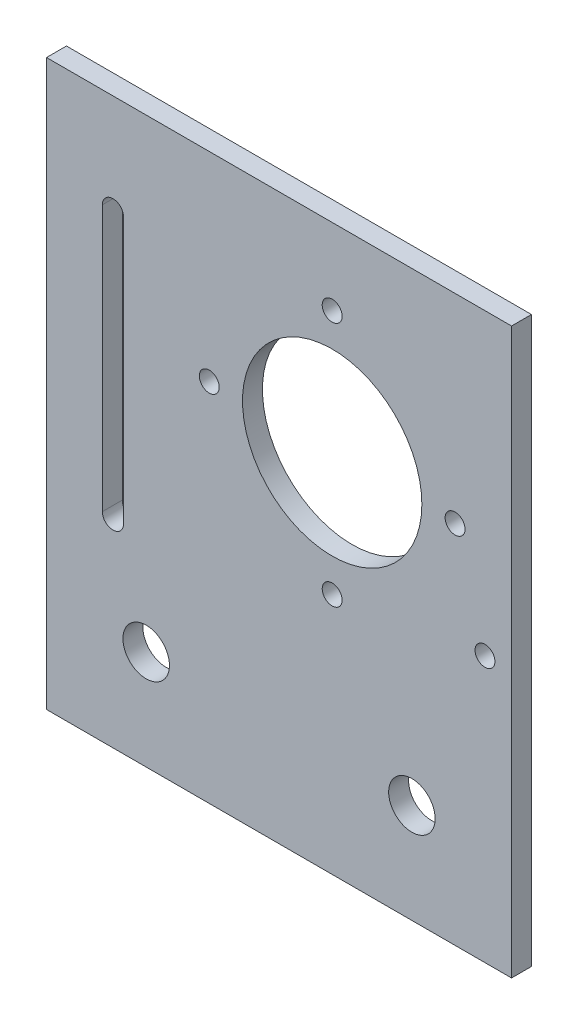
ISO-10303-21;
HEADER;
FILE_DESCRIPTION(('STEP AP214'),'2;1');
FILE_NAME('part.step','',(''),(''),'','','');
FILE_SCHEMA(('AUTOMOTIVE_DESIGN { 1 0 10303 214 1 1 1 1 }'));
ENDSEC;
DATA;
#1=APPLICATION_CONTEXT('core data for automotive mechanical design processes');
#2=APPLICATION_PROTOCOL_DEFINITION('international standard','automotive_design',2000,#1);
#3=PRODUCT_CONTEXT('',#1,'mechanical');
#4=PRODUCT('Part','Part','',(#3));
#5=PRODUCT_RELATED_PRODUCT_CATEGORY('part','',(#4));
#6=PRODUCT_DEFINITION_FORMATION('','',#4);
#7=PRODUCT_DEFINITION_CONTEXT('part definition',#1,'design');
#8=PRODUCT_DEFINITION('design','',#6,#7);
#9=PRODUCT_DEFINITION_SHAPE('','',#8);
#10=(LENGTH_UNIT() NAMED_UNIT(*) SI_UNIT(.MILLI.,.METRE.));
#11=(NAMED_UNIT(*) PLANE_ANGLE_UNIT() SI_UNIT($,.RADIAN.));
#12=(NAMED_UNIT(*) SI_UNIT($,.STERADIAN.) SOLID_ANGLE_UNIT());
#13=UNCERTAINTY_MEASURE_WITH_UNIT(LENGTH_MEASURE(1.E-05),#10,'distance_accuracy_value','');
#14=(GEOMETRIC_REPRESENTATION_CONTEXT(3) GLOBAL_UNCERTAINTY_ASSIGNED_CONTEXT((#13)) GLOBAL_UNIT_ASSIGNED_CONTEXT((#10,
#11,#12)) REPRESENTATION_CONTEXT('',''));
#15=CARTESIAN_POINT('',(0.,0.,0.));
#16=DIRECTION('',(0.,0.,1.));
#17=DIRECTION('',(1.,0.,0.));
#18=AXIS2_PLACEMENT_3D('',#15,#16,#17);
#19=CARTESIAN_POINT('',(0.,0.,3.));
#20=DIRECTION('',(0.,0.,1.));
#21=DIRECTION('',(1.,0.,0.));
#22=AXIS2_PLACEMENT_3D('',#19,#20,#21);
#23=PLANE('',#22);
#24=CARTESIAN_POINT('',(8.,-6.00000000000001,3.));
#25=DIRECTION('',(0.,0.,1.));
#26=DIRECTION('',(1.,0.,0.));
#27=AXIS2_PLACEMENT_3D('',#24,#25,#26);
#28=CIRCLE('',#27,1.5);
#29=CARTESIAN_POINT('',(9.5,-6.00000000000001,3.));
#30=VERTEX_POINT('',#29);
#31=EDGE_CURVE('E293',#30,#30,#28,.T.);
#32=ORIENTED_EDGE('',*,*,#31,.F.);
#33=EDGE_LOOP('',(#32));
#34=FACE_BOUND('',#33,.T.);
#35=CARTESIAN_POINT('',(8.,31.,3.));
#36=DIRECTION('',(0.,0.,1.));
#37=DIRECTION('',(1.,0.,0.));
#38=AXIS2_PLACEMENT_3D('',#35,#36,#37);
#39=CIRCLE('',#38,1.5);
#40=CARTESIAN_POINT('',(9.5,31.,3.));
#41=VERTEX_POINT('',#40);
#42=EDGE_CURVE('E127',#41,#41,#39,.T.);
#43=ORIENTED_EDGE('',*,*,#42,.F.);
#44=EDGE_LOOP('',(#43));
#45=FACE_BOUND('',#44,.T.);
#46=CARTESIAN_POINT('',(-20.,-27.5,3.));
#47=DIRECTION('',(0.,0.,1.));
#48=DIRECTION('',(1.,0.,0.));
#49=AXIS2_PLACEMENT_3D('',#46,#47,#48);
#50=CIRCLE('',#49,3.5);
#51=CARTESIAN_POINT('',(-16.5,-27.5,3.));
#52=VERTEX_POINT('',#51);
#53=EDGE_CURVE('E143',#52,#52,#50,.T.);
#54=ORIENTED_EDGE('',*,*,#53,.F.);
#55=EDGE_LOOP('',(#54));
#56=FACE_BOUND('',#55,.T.);
#57=CARTESIAN_POINT('',(8.,12.5,3.));
#58=DIRECTION('',(0.,0.,1.));
#59=DIRECTION('',(1.,0.,0.));
#60=AXIS2_PLACEMENT_3D('',#57,#58,#59);
#61=CIRCLE('',#60,13.5);
#62=CARTESIAN_POINT('',(21.5,12.5,3.));
#63=VERTEX_POINT('',#62);
#64=EDGE_CURVE('E155',#63,#63,#61,.T.);
#65=ORIENTED_EDGE('',*,*,#64,.F.);
#66=EDGE_LOOP('',(#65));
#67=FACE_BOUND('',#66,.T.);
#68=DIRECTION('',(0.,1.,0.));
#69=VECTOR('',#68,1.);
#70=CARTESIAN_POINT('',(35.,42.5,3.));
#71=LINE('',#70,#69);
#72=CARTESIAN_POINT('',(35.,-42.5,3.));
#73=VERTEX_POINT('',#72);
#74=CARTESIAN_POINT('',(35.,42.5,3.));
#75=VERTEX_POINT('',#74);
#76=EDGE_CURVE('E161',#73,#75,#71,.T.);
#77=ORIENTED_EDGE('',*,*,#76,.T.);
#78=DIRECTION('',(-1.,0.,0.));
#79=VECTOR('',#78,1.);
#80=CARTESIAN_POINT('',(-35.,42.5,3.));
#81=LINE('',#80,#79);
#82=CARTESIAN_POINT('',(-35.,42.5,3.));
#83=VERTEX_POINT('',#82);
#84=EDGE_CURVE('E164',#75,#83,#81,.T.);
#85=ORIENTED_EDGE('',*,*,#84,.T.);
#86=DIRECTION('',(0.,-1.,0.));
#87=VECTOR('',#86,1.);
#88=CARTESIAN_POINT('',(-35.,42.5,3.));
#89=LINE('',#88,#87);
#90=CARTESIAN_POINT('',(-35.,-42.5,3.));
#91=VERTEX_POINT('',#90);
#92=EDGE_CURVE('E167',#83,#91,#89,.T.);
#93=ORIENTED_EDGE('',*,*,#92,.T.);
#94=DIRECTION('',(1.,0.,0.));
#95=VECTOR('',#94,1.);
#96=CARTESIAN_POINT('',(-35.,-42.5,3.));
#97=LINE('',#96,#95);
#98=EDGE_CURVE('E169',#91,#73,#97,.T.);
#99=ORIENTED_EDGE('',*,*,#98,.T.);
#100=EDGE_LOOP('',(#77,#85,#93,#99));
#101=FACE_BOUND('',#100,.T.);
#102=CARTESIAN_POINT('',(31.,-2.5,3.));
#103=DIRECTION('',(0.,0.,1.));
#104=DIRECTION('',(1.,0.,0.));
#105=AXIS2_PLACEMENT_3D('',#102,#103,#104);
#106=CIRCLE('',#105,1.5);
#107=CARTESIAN_POINT('',(32.5,-2.5,3.));
#108=VERTEX_POINT('',#107);
#109=EDGE_CURVE('E149',#108,#108,#106,.T.);
#110=ORIENTED_EDGE('',*,*,#109,.F.);
#111=EDGE_LOOP('',(#110));
#112=FACE_BOUND('',#111,.T.);
#113=CARTESIAN_POINT('',(20.,-27.5,3.));
#114=DIRECTION('',(0.,0.,1.));
#115=DIRECTION('',(1.,0.,0.));
#116=AXIS2_PLACEMENT_3D('',#113,#114,#115);
#117=CIRCLE('',#116,3.5);
#118=CARTESIAN_POINT('',(23.5,-27.5,3.));
#119=VERTEX_POINT('',#118);
#120=EDGE_CURVE('E137',#119,#119,#117,.T.);
#121=ORIENTED_EDGE('',*,*,#120,.F.);
#122=EDGE_LOOP('',(#121));
#123=FACE_BOUND('',#122,.T.);
#124=DIRECTION('',(0.,1.,0.));
#125=VECTOR('',#124,1.);
#126=CARTESIAN_POINT('',(-23.4,27.5,3.));
#127=LINE('',#126,#125);
#128=CARTESIAN_POINT('',(-23.4,-12.5,3.));
#129=VERTEX_POINT('',#128);
#130=CARTESIAN_POINT('',(-23.4,27.5,3.));
#131=VERTEX_POINT('',#130);
#132=EDGE_CURVE('E106',#129,#131,#127,.T.);
#133=ORIENTED_EDGE('',*,*,#132,.F.);
#134=CARTESIAN_POINT('',(-25.,-12.5,3.));
#135=DIRECTION('',(0.,0.,1.));
#136=DIRECTION('',(1.,0.,0.));
#137=AXIS2_PLACEMENT_3D('',#134,#135,#136);
#138=CIRCLE('',#137,1.6);
#139=CARTESIAN_POINT('',(-26.6,-12.5,3.));
#140=VERTEX_POINT('',#139);
#141=EDGE_CURVE('E98',#140,#129,#138,.T.);
#142=ORIENTED_EDGE('',*,*,#141,.F.);
#143=DIRECTION('',(0.,-1.,0.));
#144=VECTOR('',#143,1.);
#145=CARTESIAN_POINT('',(-26.6,27.5,3.));
#146=LINE('',#145,#144);
#147=CARTESIAN_POINT('',(-26.6,27.5,3.));
#148=VERTEX_POINT('',#147);
#149=EDGE_CURVE('E121',#148,#140,#146,.T.);
#150=ORIENTED_EDGE('',*,*,#149,.F.);
#151=CARTESIAN_POINT('',(-25.,27.5,3.));
#152=DIRECTION('',(0.,0.,1.));
#153=DIRECTION('',(1.,0.,0.));
#154=AXIS2_PLACEMENT_3D('',#151,#152,#153);
#155=CIRCLE('',#154,1.6);
#156=EDGE_CURVE('E119',#131,#148,#155,.T.);
#157=ORIENTED_EDGE('',*,*,#156,.F.);
#158=EDGE_LOOP('',(#133,#142,#150,#157));
#159=FACE_BOUND('',#158,.T.);
#160=CARTESIAN_POINT('',(26.5,12.5,3.));
#161=DIRECTION('',(0.,0.,1.));
#162=DIRECTION('',(1.,0.,0.));
#163=AXIS2_PLACEMENT_3D('',#160,#161,#162);
#164=CIRCLE('',#163,1.5);
#165=CARTESIAN_POINT('',(28.,12.5,3.));
#166=VERTEX_POINT('',#165);
#167=EDGE_CURVE('E299',#166,#166,#164,.T.);
#168=ORIENTED_EDGE('',*,*,#167,.F.);
#169=EDGE_LOOP('',(#168));
#170=FACE_BOUND('',#169,.T.);
#171=CARTESIAN_POINT('',(-10.5,12.5,3.));
#172=DIRECTION('',(0.,0.,1.));
#173=DIRECTION('',(1.,0.,0.));
#174=AXIS2_PLACEMENT_3D('',#171,#172,#173);
#175=CIRCLE('',#174,1.5);
#176=CARTESIAN_POINT('',(-9.00000000000001,12.5,3.));
#177=VERTEX_POINT('',#176);
#178=EDGE_CURVE('E284',#177,#177,#175,.T.);
#179=ORIENTED_EDGE('',*,*,#178,.F.);
#180=EDGE_LOOP('',(#179));
#181=FACE_BOUND('',#180,.T.);
#182=ADVANCED_FACE('F33',(#34,#45,#56,#67,#101,#112,#123,#159,#170,#181),#23,.T.);
#183=CARTESIAN_POINT('',(0.,0.,0.));
#184=DIRECTION('',(0.,0.,1.));
#185=DIRECTION('',(1.,0.,0.));
#186=AXIS2_PLACEMENT_3D('',#183,#184,#185);
#187=PLANE('',#186);
#188=CARTESIAN_POINT('',(20.,-27.5,0.));
#189=DIRECTION('',(0.,0.,1.));
#190=DIRECTION('',(1.,0.,0.));
#191=AXIS2_PLACEMENT_3D('',#188,#189,#190);
#192=CIRCLE('',#191,3.5);
#193=CARTESIAN_POINT('',(23.5,-27.5,0.));
#194=VERTEX_POINT('',#193);
#195=EDGE_CURVE('E114',#194,#194,#192,.T.);
#196=ORIENTED_EDGE('',*,*,#195,.T.);
#197=EDGE_LOOP('',(#196));
#198=FACE_BOUND('',#197,.T.);
#199=CARTESIAN_POINT('',(-20.,-27.5,0.));
#200=DIRECTION('',(0.,0.,1.));
#201=DIRECTION('',(1.,0.,0.));
#202=AXIS2_PLACEMENT_3D('',#199,#200,#201);
#203=CIRCLE('',#202,3.5);
#204=CARTESIAN_POINT('',(-16.5,-27.5,0.));
#205=VERTEX_POINT('',#204);
#206=EDGE_CURVE('E140',#205,#205,#203,.T.);
#207=ORIENTED_EDGE('',*,*,#206,.T.);
#208=EDGE_LOOP('',(#207));
#209=FACE_BOUND('',#208,.T.);
#210=CARTESIAN_POINT('',(31.,-2.5,0.));
#211=DIRECTION('',(0.,0.,1.));
#212=DIRECTION('',(1.,0.,0.));
#213=AXIS2_PLACEMENT_3D('',#210,#211,#212);
#214=CIRCLE('',#213,1.5);
#215=CARTESIAN_POINT('',(32.5,-2.5,0.));
#216=VERTEX_POINT('',#215);
#217=EDGE_CURVE('E146',#216,#216,#214,.T.);
#218=ORIENTED_EDGE('',*,*,#217,.T.);
#219=EDGE_LOOP('',(#218));
#220=FACE_BOUND('',#219,.T.);
#221=CARTESIAN_POINT('',(8.,12.5,0.));
#222=DIRECTION('',(0.,0.,1.));
#223=DIRECTION('',(1.,0.,0.));
#224=AXIS2_PLACEMENT_3D('',#221,#222,#223);
#225=CIRCLE('',#224,13.5);
#226=CARTESIAN_POINT('',(21.5,12.5,0.));
#227=VERTEX_POINT('',#226);
#228=EDGE_CURVE('E152',#227,#227,#225,.T.);
#229=ORIENTED_EDGE('',*,*,#228,.T.);
#230=EDGE_LOOP('',(#229));
#231=FACE_BOUND('',#230,.T.);
#232=DIRECTION('',(0.,1.,0.));
#233=VECTOR('',#232,1.);
#234=CARTESIAN_POINT('',(35.,42.5,0.));
#235=LINE('',#234,#233);
#236=CARTESIAN_POINT('',(35.,-42.5,0.));
#237=VERTEX_POINT('',#236);
#238=CARTESIAN_POINT('',(35.,42.5,0.));
#239=VERTEX_POINT('',#238);
#240=EDGE_CURVE('E158',#237,#239,#235,.T.);
#241=ORIENTED_EDGE('',*,*,#240,.F.);
#242=DIRECTION('',(1.,0.,0.));
#243=VECTOR('',#242,1.);
#244=CARTESIAN_POINT('',(-35.,-42.5,0.));
#245=LINE('',#244,#243);
#246=CARTESIAN_POINT('',(-35.,-42.5,0.));
#247=VERTEX_POINT('',#246);
#248=EDGE_CURVE('E165',#247,#237,#245,.T.);
#249=ORIENTED_EDGE('',*,*,#248,.F.);
#250=DIRECTION('',(0.,-1.,0.));
#251=VECTOR('',#250,1.);
#252=CARTESIAN_POINT('',(-35.,42.5,0.));
#253=LINE('',#252,#251);
#254=CARTESIAN_POINT('',(-35.,42.5,0.));
#255=VERTEX_POINT('',#254);
#256=EDGE_CURVE('E176',#255,#247,#253,.T.);
#257=ORIENTED_EDGE('',*,*,#256,.F.);
#258=DIRECTION('',(-1.,0.,0.));
#259=VECTOR('',#258,1.);
#260=CARTESIAN_POINT('',(-35.,42.5,0.));
#261=LINE('',#260,#259);
#262=EDGE_CURVE('E174',#239,#255,#261,.T.);
#263=ORIENTED_EDGE('',*,*,#262,.F.);
#264=EDGE_LOOP('',(#241,#249,#257,#263));
#265=FACE_BOUND('',#264,.T.);
#266=CARTESIAN_POINT('',(-25.,-12.5,0.));
#267=DIRECTION('',(0.,0.,1.));
#268=DIRECTION('',(1.,0.,0.));
#269=AXIS2_PLACEMENT_3D('',#266,#267,#268);
#270=CIRCLE('',#269,1.6);
#271=CARTESIAN_POINT('',(-26.6,-12.5,0.));
#272=VERTEX_POINT('',#271);
#273=CARTESIAN_POINT('',(-23.4,-12.5,0.));
#274=VERTEX_POINT('',#273);
#275=EDGE_CURVE('E56',#272,#274,#270,.T.);
#276=ORIENTED_EDGE('',*,*,#275,.T.);
#277=DIRECTION('',(0.,1.,0.));
#278=VECTOR('',#277,1.);
#279=CARTESIAN_POINT('',(-23.4,27.5,0.));
#280=LINE('',#279,#278);
#281=CARTESIAN_POINT('',(-23.4,27.5,0.));
#282=VERTEX_POINT('',#281);
#283=EDGE_CURVE('E113',#274,#282,#280,.T.);
#284=ORIENTED_EDGE('',*,*,#283,.T.);
#285=CARTESIAN_POINT('',(-25.,27.5,0.));
#286=DIRECTION('',(0.,0.,1.));
#287=DIRECTION('',(1.,0.,0.));
#288=AXIS2_PLACEMENT_3D('',#285,#286,#287);
#289=CIRCLE('',#288,1.6);
#290=CARTESIAN_POINT('',(-26.6,27.5,0.));
#291=VERTEX_POINT('',#290);
#292=EDGE_CURVE('E129',#282,#291,#289,.T.);
#293=ORIENTED_EDGE('',*,*,#292,.T.);
#294=DIRECTION('',(0.,-1.,0.));
#295=VECTOR('',#294,1.);
#296=CARTESIAN_POINT('',(-26.6,27.5,0.));
#297=LINE('',#296,#295);
#298=EDGE_CURVE('E107',#291,#272,#297,.T.);
#299=ORIENTED_EDGE('',*,*,#298,.T.);
#300=EDGE_LOOP('',(#276,#284,#293,#299));
#301=FACE_BOUND('',#300,.T.);
#302=CARTESIAN_POINT('',(8.,31.,0.));
#303=DIRECTION('',(0.,0.,1.));
#304=DIRECTION('',(1.,0.,0.));
#305=AXIS2_PLACEMENT_3D('',#302,#303,#304);
#306=CIRCLE('',#305,1.5);
#307=CARTESIAN_POINT('',(9.5,31.,0.));
#308=VERTEX_POINT('',#307);
#309=EDGE_CURVE('E302',#308,#308,#306,.T.);
#310=ORIENTED_EDGE('',*,*,#309,.T.);
#311=EDGE_LOOP('',(#310));
#312=FACE_BOUND('',#311,.T.);
#313=CARTESIAN_POINT('',(26.5,12.5,0.));
#314=DIRECTION('',(0.,0.,1.));
#315=DIRECTION('',(1.,0.,0.));
#316=AXIS2_PLACEMENT_3D('',#313,#314,#315);
#317=CIRCLE('',#316,1.5);
#318=CARTESIAN_POINT('',(28.,12.5,0.));
#319=VERTEX_POINT('',#318);
#320=EDGE_CURVE('E296',#319,#319,#317,.T.);
#321=ORIENTED_EDGE('',*,*,#320,.T.);
#322=EDGE_LOOP('',(#321));
#323=FACE_BOUND('',#322,.T.);
#324=CARTESIAN_POINT('',(8.,-6.00000000000001,0.));
#325=DIRECTION('',(0.,0.,1.));
#326=DIRECTION('',(1.,0.,0.));
#327=AXIS2_PLACEMENT_3D('',#324,#325,#326);
#328=CIRCLE('',#327,1.5);
#329=CARTESIAN_POINT('',(9.5,-6.00000000000001,0.));
#330=VERTEX_POINT('',#329);
#331=EDGE_CURVE('E290',#330,#330,#328,.T.);
#332=ORIENTED_EDGE('',*,*,#331,.T.);
#333=EDGE_LOOP('',(#332));
#334=FACE_BOUND('',#333,.T.);
#335=CARTESIAN_POINT('',(-10.5,12.5,0.));
#336=DIRECTION('',(0.,0.,1.));
#337=DIRECTION('',(1.,0.,0.));
#338=AXIS2_PLACEMENT_3D('',#335,#336,#337);
#339=CIRCLE('',#338,1.5);
#340=CARTESIAN_POINT('',(-9.00000000000001,12.5,0.));
#341=VERTEX_POINT('',#340);
#342=EDGE_CURVE('E287',#341,#341,#339,.T.);
#343=ORIENTED_EDGE('',*,*,#342,.T.);
#344=EDGE_LOOP('',(#343));
#345=FACE_BOUND('',#344,.T.);
#346=ADVANCED_FACE('F194',(#198,#209,#220,#231,#265,#301,#312,#323,#334,#345),#187,.F.);
#347=CARTESIAN_POINT('',(35.,42.5,3.));
#348=DIRECTION('',(-1.,0.,0.));
#349=DIRECTION('',(0.,-1.,0.));
#350=AXIS2_PLACEMENT_3D('',#347,#348,#349);
#351=PLANE('',#350);
#352=ORIENTED_EDGE('',*,*,#240,.T.);
#353=DIRECTION('',(0.,0.,-1.));
#354=VECTOR('',#353,1.);
#355=CARTESIAN_POINT('',(35.,42.5,3.));
#356=LINE('',#355,#354);
#357=EDGE_CURVE('E11',#75,#239,#356,.T.);
#358=ORIENTED_EDGE('',*,*,#357,.F.);
#359=ORIENTED_EDGE('',*,*,#76,.F.);
#360=DIRECTION('',(0.,0.,-1.));
#361=VECTOR('',#360,1.);
#362=CARTESIAN_POINT('',(35.,-42.5,3.));
#363=LINE('',#362,#361);
#364=EDGE_CURVE('E171',#73,#237,#363,.T.);
#365=ORIENTED_EDGE('',*,*,#364,.T.);
#366=EDGE_LOOP('',(#352,#358,#359,#365));
#367=FACE_BOUND('',#366,.T.);
#368=ADVANCED_FACE('F35',(#367),#351,.F.);
#369=CARTESIAN_POINT('',(-35.,42.5,3.));
#370=DIRECTION('',(0.,-1.,0.));
#371=DIRECTION('',(0.,0.,-1.));
#372=AXIS2_PLACEMENT_3D('',#369,#370,#371);
#373=PLANE('',#372);
#374=ORIENTED_EDGE('',*,*,#262,.T.);
#375=DIRECTION('',(0.,0.,-1.));
#376=VECTOR('',#375,1.);
#377=CARTESIAN_POINT('',(-35.,42.5,3.));
#378=LINE('',#377,#376);
#379=EDGE_CURVE('E41',#83,#255,#378,.T.);
#380=ORIENTED_EDGE('',*,*,#379,.F.);
#381=ORIENTED_EDGE('',*,*,#84,.F.);
#382=ORIENTED_EDGE('',*,*,#357,.T.);
#383=EDGE_LOOP('',(#374,#380,#381,#382));
#384=FACE_BOUND('',#383,.T.);
#385=ADVANCED_FACE('F205',(#384),#373,.F.);
#386=CARTESIAN_POINT('',(-35.,42.5,3.));
#387=DIRECTION('',(1.,0.,0.));
#388=DIRECTION('',(0.,1.,0.));
#389=AXIS2_PLACEMENT_3D('',#386,#387,#388);
#390=PLANE('',#389);
#391=ORIENTED_EDGE('',*,*,#256,.T.);
#392=DIRECTION('',(0.,0.,-1.));
#393=VECTOR('',#392,1.);
#394=CARTESIAN_POINT('',(-35.,-42.5,3.));
#395=LINE('',#394,#393);
#396=EDGE_CURVE('E181',#91,#247,#395,.T.);
#397=ORIENTED_EDGE('',*,*,#396,.F.);
#398=ORIENTED_EDGE('',*,*,#92,.F.);
#399=ORIENTED_EDGE('',*,*,#379,.T.);
#400=EDGE_LOOP('',(#391,#397,#398,#399));
#401=FACE_BOUND('',#400,.T.);
#402=ADVANCED_FACE('F188',(#401),#390,.F.);
#403=CARTESIAN_POINT('',(-35.,-42.5,3.));
#404=DIRECTION('',(0.,1.,0.));
#405=DIRECTION('',(0.,0.,1.));
#406=AXIS2_PLACEMENT_3D('',#403,#404,#405);
#407=PLANE('',#406);
#408=ORIENTED_EDGE('',*,*,#248,.T.);
#409=ORIENTED_EDGE('',*,*,#364,.F.);
#410=ORIENTED_EDGE('',*,*,#98,.F.);
#411=ORIENTED_EDGE('',*,*,#396,.T.);
#412=EDGE_LOOP('',(#408,#409,#410,#411));
#413=FACE_BOUND('',#412,.T.);
#414=ADVANCED_FACE('F198',(#413),#407,.F.);
#415=CARTESIAN_POINT('',(8.,12.5,3.));
#416=DIRECTION('',(0.,0.,-1.));
#417=DIRECTION('',(-1.,0.,0.));
#418=AXIS2_PLACEMENT_3D('',#415,#416,#417);
#419=CYLINDRICAL_SURFACE('',#418,13.5);
#420=ORIENTED_EDGE('',*,*,#64,.T.);
#421=EDGE_LOOP('',(#420));
#422=FACE_BOUND('',#421,.T.);
#423=ORIENTED_EDGE('',*,*,#228,.F.);
#424=EDGE_LOOP('',(#423));
#425=FACE_BOUND('',#424,.T.);
#426=ADVANCED_FACE('F223',(#422,#425),#419,.F.);
#427=CARTESIAN_POINT('',(31.,-2.5,3.));
#428=DIRECTION('',(0.,0.,-1.));
#429=DIRECTION('',(-1.,0.,0.));
#430=AXIS2_PLACEMENT_3D('',#427,#428,#429);
#431=CYLINDRICAL_SURFACE('',#430,1.5);
#432=ORIENTED_EDGE('',*,*,#109,.T.);
#433=EDGE_LOOP('',(#432));
#434=FACE_BOUND('',#433,.T.);
#435=ORIENTED_EDGE('',*,*,#217,.F.);
#436=EDGE_LOOP('',(#435));
#437=FACE_BOUND('',#436,.T.);
#438=ADVANCED_FACE('F230',(#434,#437),#431,.F.);
#439=CARTESIAN_POINT('',(-20.,-27.5,3.));
#440=DIRECTION('',(0.,0.,-1.));
#441=DIRECTION('',(-1.,0.,0.));
#442=AXIS2_PLACEMENT_3D('',#439,#440,#441);
#443=CYLINDRICAL_SURFACE('',#442,3.5);
#444=ORIENTED_EDGE('',*,*,#53,.T.);
#445=EDGE_LOOP('',(#444));
#446=FACE_BOUND('',#445,.T.);
#447=ORIENTED_EDGE('',*,*,#206,.F.);
#448=EDGE_LOOP('',(#447));
#449=FACE_BOUND('',#448,.T.);
#450=ADVANCED_FACE('F235',(#446,#449),#443,.F.);
#451=CARTESIAN_POINT('',(20.,-27.5,3.));
#452=DIRECTION('',(0.,0.,-1.));
#453=DIRECTION('',(-1.,0.,0.));
#454=AXIS2_PLACEMENT_3D('',#451,#452,#453);
#455=CYLINDRICAL_SURFACE('',#454,3.5);
#456=ORIENTED_EDGE('',*,*,#120,.T.);
#457=EDGE_LOOP('',(#456));
#458=FACE_BOUND('',#457,.T.);
#459=ORIENTED_EDGE('',*,*,#195,.F.);
#460=EDGE_LOOP('',(#459));
#461=FACE_BOUND('',#460,.T.);
#462=ADVANCED_FACE('F245',(#458,#461),#455,.F.);
#463=CARTESIAN_POINT('',(-25.,-12.5,3.));
#464=DIRECTION('',(0.,0.,-1.));
#465=DIRECTION('',(-1.,0.,0.));
#466=AXIS2_PLACEMENT_3D('',#463,#464,#465);
#467=CYLINDRICAL_SURFACE('',#466,1.6);
#468=ORIENTED_EDGE('',*,*,#275,.F.);
#469=DIRECTION('',(0.,0.,-1.));
#470=VECTOR('',#469,1.);
#471=CARTESIAN_POINT('',(-26.6,-12.5,3.));
#472=LINE('',#471,#470);
#473=EDGE_CURVE('E102',#140,#272,#472,.T.);
#474=ORIENTED_EDGE('',*,*,#473,.F.);
#475=ORIENTED_EDGE('',*,*,#141,.T.);
#476=DIRECTION('',(0.,0.,-1.));
#477=VECTOR('',#476,1.);
#478=CARTESIAN_POINT('',(-23.4,-12.5,3.));
#479=LINE('',#478,#477);
#480=EDGE_CURVE('E101',#129,#274,#479,.T.);
#481=ORIENTED_EDGE('',*,*,#480,.T.);
#482=EDGE_LOOP('',(#468,#474,#475,#481));
#483=FACE_BOUND('',#482,.T.);
#484=ADVANCED_FACE('F100',(#483),#467,.F.);
#485=CARTESIAN_POINT('',(-23.4,27.5,3.));
#486=DIRECTION('',(-1.,0.,0.));
#487=DIRECTION('',(0.,-1.,0.));
#488=AXIS2_PLACEMENT_3D('',#485,#486,#487);
#489=PLANE('',#488);
#490=ORIENTED_EDGE('',*,*,#283,.F.);
#491=ORIENTED_EDGE('',*,*,#480,.F.);
#492=ORIENTED_EDGE('',*,*,#132,.T.);
#493=DIRECTION('',(0.,0.,-1.));
#494=VECTOR('',#493,1.);
#495=CARTESIAN_POINT('',(-23.4,27.5,3.));
#496=LINE('',#495,#494);
#497=EDGE_CURVE('E115',#131,#282,#496,.T.);
#498=ORIENTED_EDGE('',*,*,#497,.T.);
#499=EDGE_LOOP('',(#490,#491,#492,#498));
#500=FACE_BOUND('',#499,.T.);
#501=ADVANCED_FACE('F110',(#500),#489,.T.);
#502=CARTESIAN_POINT('',(-25.,27.5,3.));
#503=DIRECTION('',(0.,0.,-1.));
#504=DIRECTION('',(-1.,0.,0.));
#505=AXIS2_PLACEMENT_3D('',#502,#503,#504);
#506=CYLINDRICAL_SURFACE('',#505,1.6);
#507=ORIENTED_EDGE('',*,*,#292,.F.);
#508=ORIENTED_EDGE('',*,*,#497,.F.);
#509=ORIENTED_EDGE('',*,*,#156,.T.);
#510=DIRECTION('',(0.,0.,-1.));
#511=VECTOR('',#510,1.);
#512=CARTESIAN_POINT('',(-26.6,27.5,3.));
#513=LINE('',#512,#511);
#514=EDGE_CURVE('E48',#148,#291,#513,.T.);
#515=ORIENTED_EDGE('',*,*,#514,.T.);
#516=EDGE_LOOP('',(#507,#508,#509,#515));
#517=FACE_BOUND('',#516,.T.);
#518=ADVANCED_FACE('F257',(#517),#506,.F.);
#519=CARTESIAN_POINT('',(-26.6,27.5,3.));
#520=DIRECTION('',(1.,0.,0.));
#521=DIRECTION('',(0.,1.,0.));
#522=AXIS2_PLACEMENT_3D('',#519,#520,#521);
#523=PLANE('',#522);
#524=ORIENTED_EDGE('',*,*,#298,.F.);
#525=ORIENTED_EDGE('',*,*,#514,.F.);
#526=ORIENTED_EDGE('',*,*,#149,.T.);
#527=ORIENTED_EDGE('',*,*,#473,.T.);
#528=EDGE_LOOP('',(#524,#525,#526,#527));
#529=FACE_BOUND('',#528,.T.);
#530=ADVANCED_FACE('F260',(#529),#523,.T.);
#531=CARTESIAN_POINT('',(8.,31.,3.));
#532=DIRECTION('',(0.,0.,-1.));
#533=DIRECTION('',(-1.,0.,0.));
#534=AXIS2_PLACEMENT_3D('',#531,#532,#533);
#535=CYLINDRICAL_SURFACE('',#534,1.5);
#536=ORIENTED_EDGE('',*,*,#42,.T.);
#537=EDGE_LOOP('',(#536));
#538=FACE_BOUND('',#537,.T.);
#539=ORIENTED_EDGE('',*,*,#309,.F.);
#540=EDGE_LOOP('',(#539));
#541=FACE_BOUND('',#540,.T.);
#542=ADVANCED_FACE('F264',(#538,#541),#535,.F.);
#543=CARTESIAN_POINT('',(26.5,12.5,3.));
#544=DIRECTION('',(0.,0.,-1.));
#545=DIRECTION('',(-1.,0.,0.));
#546=AXIS2_PLACEMENT_3D('',#543,#544,#545);
#547=CYLINDRICAL_SURFACE('',#546,1.5);
#548=ORIENTED_EDGE('',*,*,#167,.T.);
#549=EDGE_LOOP('',(#548));
#550=FACE_BOUND('',#549,.T.);
#551=ORIENTED_EDGE('',*,*,#320,.F.);
#552=EDGE_LOOP('',(#551));
#553=FACE_BOUND('',#552,.T.);
#554=ADVANCED_FACE('F267',(#550,#553),#547,.F.);
#555=CARTESIAN_POINT('',(8.,-6.00000000000001,3.));
#556=DIRECTION('',(0.,0.,-1.));
#557=DIRECTION('',(-1.,0.,0.));
#558=AXIS2_PLACEMENT_3D('',#555,#556,#557);
#559=CYLINDRICAL_SURFACE('',#558,1.5);
#560=ORIENTED_EDGE('',*,*,#31,.T.);
#561=EDGE_LOOP('',(#560));
#562=FACE_BOUND('',#561,.T.);
#563=ORIENTED_EDGE('',*,*,#331,.F.);
#564=EDGE_LOOP('',(#563));
#565=FACE_BOUND('',#564,.T.);
#566=ADVANCED_FACE('F271',(#562,#565),#559,.F.);
#567=CARTESIAN_POINT('',(-10.5,12.5,3.));
#568=DIRECTION('',(0.,0.,-1.));
#569=DIRECTION('',(-1.,0.,0.));
#570=AXIS2_PLACEMENT_3D('',#567,#568,#569);
#571=CYLINDRICAL_SURFACE('',#570,1.5);
#572=ORIENTED_EDGE('',*,*,#178,.T.);
#573=EDGE_LOOP('',(#572));
#574=FACE_BOUND('',#573,.T.);
#575=ORIENTED_EDGE('',*,*,#342,.F.);
#576=EDGE_LOOP('',(#575));
#577=FACE_BOUND('',#576,.T.);
#578=ADVANCED_FACE('F275',(#574,#577),#571,.F.);
#579=CLOSED_SHELL('',(#182,#346,#368,#385,#402,#414,#426,#438,#450,#462,#484,#501,#518,#530,
#542,#554,#566,#578));
#580=MANIFOLD_SOLID_BREP('B2',#579);
#581=ADVANCED_BREP_SHAPE_REPRESENTATION('',(#18,#580),#14);
#582=SHAPE_DEFINITION_REPRESENTATION(#9,#581);
ENDSEC;
END-ISO-10303-21;
